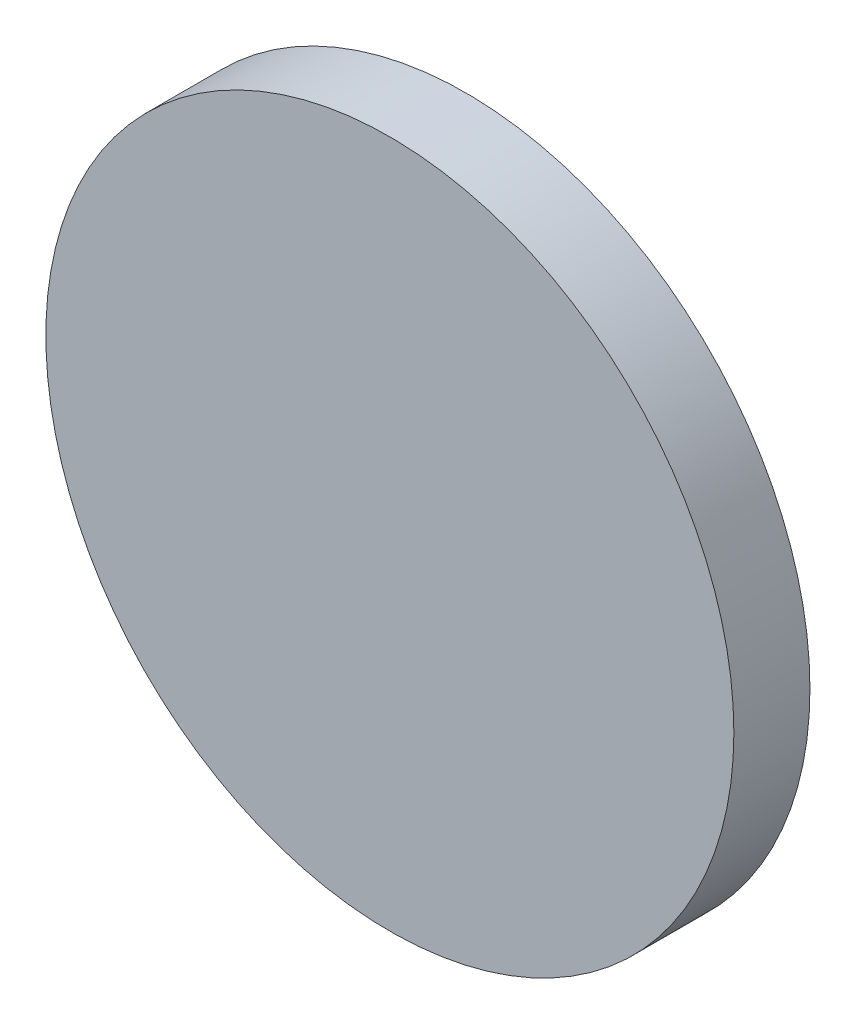
ISO-10303-21;
HEADER;
FILE_DESCRIPTION(('STEP AP214'),'2;1');
FILE_NAME('part.step','',(''),(''),'','','');
FILE_SCHEMA(('AUTOMOTIVE_DESIGN { 1 0 10303 214 1 1 1 1 }'));
ENDSEC;
DATA;
#1=APPLICATION_CONTEXT('core data for automotive mechanical design processes');
#2=APPLICATION_PROTOCOL_DEFINITION('international standard','automotive_design',2000,#1);
#3=PRODUCT_CONTEXT('',#1,'mechanical');
#4=PRODUCT('Part','Part','',(#3));
#5=PRODUCT_RELATED_PRODUCT_CATEGORY('part','',(#4));
#6=PRODUCT_DEFINITION_FORMATION('','',#4);
#7=PRODUCT_DEFINITION_CONTEXT('part definition',#1,'design');
#8=PRODUCT_DEFINITION('design','',#6,#7);
#9=PRODUCT_DEFINITION_SHAPE('','',#8);
#10=(LENGTH_UNIT() NAMED_UNIT(*) SI_UNIT(.MILLI.,.METRE.));
#11=(NAMED_UNIT(*) PLANE_ANGLE_UNIT() SI_UNIT($,.RADIAN.));
#12=(NAMED_UNIT(*) SI_UNIT($,.STERADIAN.) SOLID_ANGLE_UNIT());
#13=UNCERTAINTY_MEASURE_WITH_UNIT(LENGTH_MEASURE(1.E-05),#10,'distance_accuracy_value','');
#14=(GEOMETRIC_REPRESENTATION_CONTEXT(3) GLOBAL_UNCERTAINTY_ASSIGNED_CONTEXT((#13)) GLOBAL_UNIT_ASSIGNED_CONTEXT((#10,
#11,#12)) REPRESENTATION_CONTEXT('',''));
#15=CARTESIAN_POINT('',(0.,0.,0.));
#16=DIRECTION('',(0.,0.,1.));
#17=DIRECTION('',(1.,0.,0.));
#18=AXIS2_PLACEMENT_3D('',#15,#16,#17);
#19=CARTESIAN_POINT('',(0.,10.4,0.));
#20=DIRECTION('',(0.,0.,-1.));
#21=DIRECTION('',(-1.,0.,0.));
#22=AXIS2_PLACEMENT_3D('',#19,#20,#21);
#23=PLANE('',#22);
#24=CARTESIAN_POINT('',(0.,0.,0.));
#25=DIRECTION('',(0.,0.,1.));
#26=DIRECTION('',(1.,0.,0.));
#27=AXIS2_PLACEMENT_3D('',#24,#25,#26);
#28=CIRCLE('',#27,10.4);
#29=CARTESIAN_POINT('',(10.4,0.,0.));
#30=VERTEX_POINT('',#29);
#31=EDGE_CURVE('E10',#30,#30,#28,.T.);
#32=ORIENTED_EDGE('',*,*,#31,.T.);
#33=EDGE_LOOP('',(#32));
#34=FACE_BOUND('',#33,.T.);
#35=ADVANCED_FACE('F33',(#34),#23,.F.);
#36=CARTESIAN_POINT('',(0.,0.,0.));
#37=DIRECTION('',(0.,0.,1.));
#38=DIRECTION('',(1.,0.,0.));
#39=AXIS2_PLACEMENT_3D('',#36,#37,#38);
#40=CYLINDRICAL_SURFACE('',#39,10.4);
#41=ORIENTED_EDGE('',*,*,#31,.F.);
#42=EDGE_LOOP('',(#41));
#43=FACE_BOUND('',#42,.T.);
#44=CARTESIAN_POINT('',(0.,0.,-2.3));
#45=DIRECTION('',(0.,0.,1.));
#46=DIRECTION('',(1.,0.,0.));
#47=AXIS2_PLACEMENT_3D('',#44,#45,#46);
#48=CIRCLE('',#47,10.4);
#49=CARTESIAN_POINT('',(10.4,0.,-2.3));
#50=VERTEX_POINT('',#49);
#51=EDGE_CURVE('E39',#50,#50,#48,.T.);
#52=ORIENTED_EDGE('',*,*,#51,.T.);
#53=EDGE_LOOP('',(#52));
#54=FACE_BOUND('',#53,.T.);
#55=ADVANCED_FACE('F81',(#43,#54),#40,.T.);
#56=CARTESIAN_POINT('',(0.,10.4,-2.3));
#57=DIRECTION('',(0.,0.,1.));
#58=DIRECTION('',(1.,0.,0.));
#59=AXIS2_PLACEMENT_3D('',#56,#57,#58);
#60=PLANE('',#59);
#61=ORIENTED_EDGE('',*,*,#51,.F.);
#62=EDGE_LOOP('',(#61));
#63=FACE_BOUND('',#62,.T.);
#64=CARTESIAN_POINT('',(0.,0.,-2.3));
#65=DIRECTION('',(0.,0.,1.));
#66=DIRECTION('',(1.,0.,0.));
#67=AXIS2_PLACEMENT_3D('',#64,#65,#66);
#68=CIRCLE('',#67,4.4);
#69=CARTESIAN_POINT('',(4.4,0.,-2.3));
#70=VERTEX_POINT('',#69);
#71=EDGE_CURVE('E43',#70,#70,#68,.T.);
#72=ORIENTED_EDGE('',*,*,#71,.T.);
#73=EDGE_LOOP('',(#72));
#74=FACE_BOUND('',#73,.T.);
#75=ADVANCED_FACE('F75',(#63,#74),#60,.F.);
#76=CARTESIAN_POINT('',(0.,0.,0.));
#77=DIRECTION('',(0.,0.,1.));
#78=DIRECTION('',(1.,0.,0.));
#79=AXIS2_PLACEMENT_3D('',#76,#77,#78);
#80=CYLINDRICAL_SURFACE('',#79,4.4);
#81=ORIENTED_EDGE('',*,*,#71,.F.);
#82=EDGE_LOOP('',(#81));
#83=FACE_BOUND('',#82,.T.);
#84=CARTESIAN_POINT('',(0.,0.,-5.5));
#85=DIRECTION('',(0.,0.,1.));
#86=DIRECTION('',(1.,0.,0.));
#87=AXIS2_PLACEMENT_3D('',#84,#85,#86);
#88=CIRCLE('',#87,4.4);
#89=CARTESIAN_POINT('',(4.4,0.,-5.5));
#90=VERTEX_POINT('',#89);
#91=EDGE_CURVE('E47',#90,#90,#88,.T.);
#92=ORIENTED_EDGE('',*,*,#91,.T.);
#93=EDGE_LOOP('',(#92));
#94=FACE_BOUND('',#93,.T.);
#95=ADVANCED_FACE('F70',(#83,#94),#80,.T.);
#96=CARTESIAN_POINT('',(0.,4.4,-5.5));
#97=DIRECTION('',(0.,0.,1.));
#98=DIRECTION('',(1.,0.,0.));
#99=AXIS2_PLACEMENT_3D('',#96,#97,#98);
#100=PLANE('',#99);
#101=CARTESIAN_POINT('',(0.,0.,-5.5));
#102=DIRECTION('',(0.,0.,-1.));
#103=DIRECTION('',(-1.,0.,0.));
#104=AXIS2_PLACEMENT_3D('',#101,#102,#103);
#105=CIRCLE('',#104,2.6);
#106=CARTESIAN_POINT('',(-2.6,0.,-5.5));
#107=VERTEX_POINT('',#106);
#108=EDGE_CURVE('E53',#107,#107,#105,.T.);
#109=ORIENTED_EDGE('',*,*,#108,.F.);
#110=EDGE_LOOP('',(#109));
#111=FACE_BOUND('',#110,.T.);
#112=ORIENTED_EDGE('',*,*,#91,.F.);
#113=EDGE_LOOP('',(#112));
#114=FACE_BOUND('',#113,.T.);
#115=ADVANCED_FACE('F64',(#111,#114),#100,.F.);
#116=CARTESIAN_POINT('',(0.,0.,-2.5));
#117=DIRECTION('',(0.,0.,-1.));
#118=DIRECTION('',(-1.,0.,0.));
#119=AXIS2_PLACEMENT_3D('',#116,#117,#118);
#120=CYLINDRICAL_SURFACE('',#119,2.6);
#121=CARTESIAN_POINT('',(0.,0.,-2.5));
#122=DIRECTION('',(0.,0.,-1.));
#123=DIRECTION('',(-1.,0.,0.));
#124=AXIS2_PLACEMENT_3D('',#121,#122,#123);
#125=CIRCLE('',#124,2.6);
#126=CARTESIAN_POINT('',(-2.6,0.,-2.5));
#127=VERTEX_POINT('',#126);
#128=EDGE_CURVE('E52',#127,#127,#125,.T.);
#129=ORIENTED_EDGE('',*,*,#128,.F.);
#130=EDGE_LOOP('',(#129));
#131=FACE_BOUND('',#130,.T.);
#132=ORIENTED_EDGE('',*,*,#108,.T.);
#133=EDGE_LOOP('',(#132));
#134=FACE_BOUND('',#133,.T.);
#135=ADVANCED_FACE('F61',(#131,#134),#120,.F.);
#136=CARTESIAN_POINT('',(0.,0.,-2.5));
#137=DIRECTION('',(0.,0.,-1.));
#138=DIRECTION('',(-1.,0.,0.));
#139=AXIS2_PLACEMENT_3D('',#136,#137,#138);
#140=PLANE('',#139);
#141=ORIENTED_EDGE('',*,*,#128,.T.);
#142=EDGE_LOOP('',(#141));
#143=FACE_BOUND('',#142,.T.);
#144=ADVANCED_FACE('F59',(#143),#140,.T.);
#145=CLOSED_SHELL('',(#35,#55,#75,#95,#115,#135,#144));
#146=MANIFOLD_SOLID_BREP('B2',#145);
#147=ADVANCED_BREP_SHAPE_REPRESENTATION('',(#18,#146),#14);
#148=SHAPE_DEFINITION_REPRESENTATION(#9,#147);
ENDSEC;
END-ISO-10303-21;
